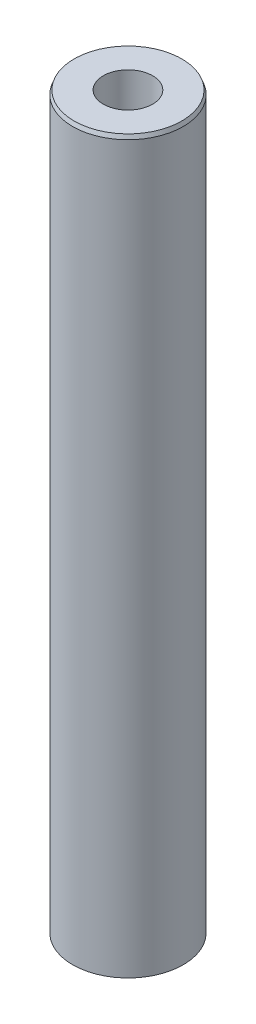
ISO-10303-21;
HEADER;
FILE_DESCRIPTION(('STEP AP214'),'2;1');
FILE_NAME('part.step','',(''),(''),'','','');
FILE_SCHEMA(('AUTOMOTIVE_DESIGN { 1 0 10303 214 1 1 1 1 }'));
ENDSEC;
DATA;
#1=APPLICATION_CONTEXT('core data for automotive mechanical design processes');
#2=APPLICATION_PROTOCOL_DEFINITION('international standard','automotive_design',2000,#1);
#3=PRODUCT_CONTEXT('',#1,'mechanical');
#4=PRODUCT('Part','Part','',(#3));
#5=PRODUCT_RELATED_PRODUCT_CATEGORY('part','',(#4));
#6=PRODUCT_DEFINITION_FORMATION('','',#4);
#7=PRODUCT_DEFINITION_CONTEXT('part definition',#1,'design');
#8=PRODUCT_DEFINITION('design','',#6,#7);
#9=PRODUCT_DEFINITION_SHAPE('','',#8);
#10=(LENGTH_UNIT() NAMED_UNIT(*) SI_UNIT(.MILLI.,.METRE.));
#11=(NAMED_UNIT(*) PLANE_ANGLE_UNIT() SI_UNIT($,.RADIAN.));
#12=(NAMED_UNIT(*) SI_UNIT($,.STERADIAN.) SOLID_ANGLE_UNIT());
#13=UNCERTAINTY_MEASURE_WITH_UNIT(LENGTH_MEASURE(1.E-05),#10,'distance_accuracy_value','');
#14=(GEOMETRIC_REPRESENTATION_CONTEXT(3) GLOBAL_UNCERTAINTY_ASSIGNED_CONTEXT((#13)) GLOBAL_UNIT_ASSIGNED_CONTEXT((#10,
#11,#12)) REPRESENTATION_CONTEXT('',''));
#15=CARTESIAN_POINT('',(0.,0.,0.));
#16=DIRECTION('',(0.,0.,1.));
#17=DIRECTION('',(1.,0.,0.));
#18=AXIS2_PLACEMENT_3D('',#15,#16,#17);
#19=CARTESIAN_POINT('',(0.,165.31760869932,0.));
#20=DIRECTION('',(0.,-1.,0.));
#21=DIRECTION('',(0.,0.,-1.));
#22=AXIS2_PLACEMENT_3D('',#19,#20,#21);
#23=CYLINDRICAL_SURFACE('',#22,12.5);
#24=CARTESIAN_POINT('',(0.,164.404385682132,0.));
#25=DIRECTION('',(0.,1.,0.));
#26=DIRECTION('',(0.,0.,1.));
#27=AXIS2_PLACEMENT_3D('',#24,#25,#26);
#28=CIRCLE('',#27,12.5);
#29=CARTESIAN_POINT('',(0.,164.404385682132,12.5));
#30=VERTEX_POINT('',#29);
#31=EDGE_CURVE('E50',#30,#30,#28,.F.);
#32=ORIENTED_EDGE('',*,*,#31,.T.);
#33=EDGE_LOOP('',(#32));
#34=FACE_BOUND('',#33,.T.);
#35=CARTESIAN_POINT('',(0.,0.333913214512011,0.));
#36=DIRECTION('',(0.,1.,0.));
#37=DIRECTION('',(0.,0.,1.));
#38=AXIS2_PLACEMENT_3D('',#35,#36,#37);
#39=CIRCLE('',#38,12.5);
#40=CARTESIAN_POINT('',(0.,0.333913214512011,12.5));
#41=VERTEX_POINT('',#40);
#42=EDGE_CURVE('E51',#41,#41,#39,.T.);
#43=ORIENTED_EDGE('',*,*,#42,.T.);
#44=EDGE_LOOP('',(#43));
#45=FACE_BOUND('',#44,.T.);
#46=ADVANCED_FACE('F39',(#34,#45),#23,.T.);
#47=CARTESIAN_POINT('',(0.,165.31760869932,0.));
#48=DIRECTION('',(0.,1.,0.));
#49=DIRECTION('',(0.,0.,1.));
#50=AXIS2_PLACEMENT_3D('',#47,#48,#49);
#51=PLANE('',#50);
#52=CARTESIAN_POINT('',(0.,165.31760869932,0.));
#53=DIRECTION('',(0.,1.,0.));
#54=DIRECTION('',(0.,0.,1.));
#55=AXIS2_PLACEMENT_3D('',#52,#53,#54);
#56=CIRCLE('',#55,12.166086785488);
#57=CARTESIAN_POINT('',(0.,165.31760869932,12.166086785488));
#58=VERTEX_POINT('',#57);
#59=EDGE_CURVE('E54',#58,#58,#56,.T.);
#60=ORIENTED_EDGE('',*,*,#59,.T.);
#61=EDGE_LOOP('',(#60));
#62=FACE_BOUND('',#61,.T.);
#63=CARTESIAN_POINT('',(0.,165.31760869932,0.));
#64=DIRECTION('',(0.,1.,0.));
#65=DIRECTION('',(0.,0.,1.));
#66=AXIS2_PLACEMENT_3D('',#63,#64,#65);
#67=CIRCLE('',#66,5.57673123007178);
#68=CARTESIAN_POINT('',(0.,165.31760869932,5.57673123007178));
#69=VERTEX_POINT('',#68);
#70=EDGE_CURVE('E58',#69,#69,#67,.T.);
#71=ORIENTED_EDGE('',*,*,#70,.F.);
#72=EDGE_LOOP('',(#71));
#73=FACE_BOUND('',#72,.T.);
#74=ADVANCED_FACE('F69',(#62,#73),#51,.T.);
#75=CARTESIAN_POINT('',(0.,0.,0.));
#76=DIRECTION('',(0.,1.,0.));
#77=DIRECTION('',(0.,0.,1.));
#78=AXIS2_PLACEMENT_3D('',#75,#76,#77);
#79=PLANE('',#78);
#80=CARTESIAN_POINT('',(0.,0.,0.));
#81=DIRECTION('',(0.,1.,0.));
#82=DIRECTION('',(0.,0.,1.));
#83=AXIS2_PLACEMENT_3D('',#80,#81,#82);
#84=CIRCLE('',#83,11.586776982812);
#85=CARTESIAN_POINT('',(0.,0.,11.586776982812));
#86=VERTEX_POINT('',#85);
#87=EDGE_CURVE('E10',#86,#86,#84,.F.);
#88=ORIENTED_EDGE('',*,*,#87,.T.);
#89=EDGE_LOOP('',(#88));
#90=FACE_BOUND('',#89,.T.);
#91=CARTESIAN_POINT('',(0.,0.,0.));
#92=DIRECTION('',(0.,1.,0.));
#93=DIRECTION('',(0.,0.,1.));
#94=AXIS2_PLACEMENT_3D('',#91,#92,#93);
#95=CIRCLE('',#94,5.57673123007178);
#96=CARTESIAN_POINT('',(0.,0.,5.57673123007178));
#97=VERTEX_POINT('',#96);
#98=EDGE_CURVE('E63',#97,#97,#95,.T.);
#99=ORIENTED_EDGE('',*,*,#98,.T.);
#100=EDGE_LOOP('',(#99));
#101=FACE_BOUND('',#100,.T.);
#102=ADVANCED_FACE('F75',(#90,#101),#79,.F.);
#103=CARTESIAN_POINT('',(0.,165.31760869932,0.));
#104=DIRECTION('',(0.,-1.,0.));
#105=DIRECTION('',(0.,0.,-1.));
#106=AXIS2_PLACEMENT_3D('',#103,#104,#105);
#107=CYLINDRICAL_SURFACE('',#106,5.57673123007178);
#108=ORIENTED_EDGE('',*,*,#70,.T.);
#109=EDGE_LOOP('',(#108));
#110=FACE_BOUND('',#109,.T.);
#111=ORIENTED_EDGE('',*,*,#98,.F.);
#112=EDGE_LOOP('',(#111));
#113=FACE_BOUND('',#112,.T.);
#114=ADVANCED_FACE('F70',(#110,#113),#107,.F.);
#115=CARTESIAN_POINT('',(0.,165.31760869932,0.));
#116=DIRECTION('',(0.,-1.,0.));
#117=DIRECTION('',(0.,0.,-1.));
#118=AXIS2_PLACEMENT_3D('',#115,#116,#117);
#119=CONICAL_SURFACE('',#118,12.166086785488,0.350541769072973);
#120=ORIENTED_EDGE('',*,*,#31,.F.);
#121=EDGE_LOOP('',(#120));
#122=FACE_BOUND('',#121,.T.);
#123=ORIENTED_EDGE('',*,*,#59,.F.);
#124=EDGE_LOOP('',(#123));
#125=FACE_BOUND('',#124,.T.);
#126=ADVANCED_FACE('F81',(#122,#125),#119,.T.);
#127=CARTESIAN_POINT('',(0.,0.333913214512011,0.));
#128=DIRECTION('',(0.,1.,0.));
#129=DIRECTION('',(0.,0.,1.));
#130=AXIS2_PLACEMENT_3D('',#127,#128,#129);
#131=CONICAL_SURFACE('',#130,12.5,1.22025455772191);
#132=ORIENTED_EDGE('',*,*,#87,.F.);
#133=EDGE_LOOP('',(#132));
#134=FACE_BOUND('',#133,.T.);
#135=ORIENTED_EDGE('',*,*,#42,.F.);
#136=EDGE_LOOP('',(#135));
#137=FACE_BOUND('',#136,.T.);
#138=ADVANCED_FACE('F45',(#134,#137),#131,.T.);
#139=CLOSED_SHELL('',(#46,#74,#102,#114,#126,#138));
#140=MANIFOLD_SOLID_BREP('B2',#139);
#141=ADVANCED_BREP_SHAPE_REPRESENTATION('',(#18,#140),#14);
#142=SHAPE_DEFINITION_REPRESENTATION(#9,#141);
ENDSEC;
END-ISO-10303-21;
